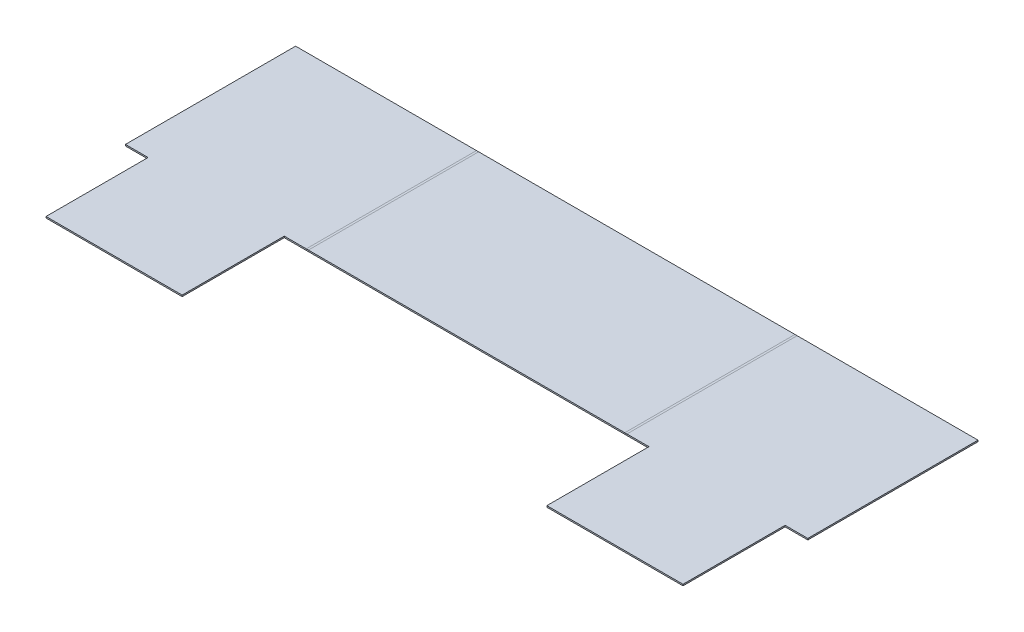
ISO-10303-21;
HEADER;
FILE_DESCRIPTION(('STEP AP214'),'2;1');
FILE_NAME('part.step','',(''),(''),'','','');
FILE_SCHEMA(('AUTOMOTIVE_DESIGN { 1 0 10303 214 1 1 1 1 }'));
ENDSEC;
DATA;
#1=APPLICATION_CONTEXT('core data for automotive mechanical design processes');
#2=APPLICATION_PROTOCOL_DEFINITION('international standard','automotive_design',2000,#1);
#3=PRODUCT_CONTEXT('',#1,'mechanical');
#4=PRODUCT('Part','Part','',(#3));
#5=PRODUCT_RELATED_PRODUCT_CATEGORY('part','',(#4));
#6=PRODUCT_DEFINITION_FORMATION('','',#4);
#7=PRODUCT_DEFINITION_CONTEXT('part definition',#1,'design');
#8=PRODUCT_DEFINITION('design','',#6,#7);
#9=PRODUCT_DEFINITION_SHAPE('','',#8);
#10=(LENGTH_UNIT() NAMED_UNIT(*) SI_UNIT(.MILLI.,.METRE.));
#11=(NAMED_UNIT(*) PLANE_ANGLE_UNIT() SI_UNIT($,.RADIAN.));
#12=(NAMED_UNIT(*) SI_UNIT($,.STERADIAN.) SOLID_ANGLE_UNIT());
#13=UNCERTAINTY_MEASURE_WITH_UNIT(LENGTH_MEASURE(1.E-05),#10,'distance_accuracy_value','');
#14=(GEOMETRIC_REPRESENTATION_CONTEXT(3) GLOBAL_UNCERTAINTY_ASSIGNED_CONTEXT((#13)) GLOBAL_UNIT_ASSIGNED_CONTEXT((#10,
#11,#12)) REPRESENTATION_CONTEXT('',''));
#15=CARTESIAN_POINT('',(0.,0.,0.));
#16=DIRECTION('',(0.,0.,1.));
#17=DIRECTION('',(1.,0.,0.));
#18=AXIS2_PLACEMENT_3D('',#15,#16,#17);
#19=CARTESIAN_POINT('',(-1.58750000000069,204.787500000001,127.));
#20=DIRECTION('',(0.,0.,1.));
#21=DIRECTION('',(0.,-1.,0.));
#22=AXIS2_PLACEMENT_3D('',#19,#20,#21);
#23=PLANE('',#22);
#24=DIRECTION('',(-1.,0.,0.));
#25=VECTOR('',#24,1.);
#26=CARTESIAN_POINT('',(355.6,0.,127.));
#27=LINE('',#26,#25);
#28=CARTESIAN_POINT('',(354.8634,0.,127.));
#29=VERTEX_POINT('',#28);
#30=CARTESIAN_POINT('',(0.736599999999959,0.,127.));
#31=VERTEX_POINT('',#30);
#32=EDGE_CURVE('E316',#29,#31,#27,.T.);
#33=ORIENTED_EDGE('',*,*,#32,.T.);
#34=DIRECTION('',(0.,1.,0.));
#35=VECTOR('',#34,1.);
#36=CARTESIAN_POINT('',(0.736599999999995,0.,127.));
#37=LINE('',#36,#35);
#38=CARTESIAN_POINT('',(0.736599999999995,1.58749999999999,127.));
#39=VERTEX_POINT('',#38);
#40=EDGE_CURVE('E11',#31,#39,#37,.T.);
#41=ORIENTED_EDGE('',*,*,#40,.T.);
#42=DIRECTION('',(-1.,0.,0.));
#43=VECTOR('',#42,1.);
#44=CARTESIAN_POINT('',(355.6,1.58749999999998,127.));
#45=LINE('',#44,#43);
#46=CARTESIAN_POINT('',(354.8634,1.58749999999998,127.));
#47=VERTEX_POINT('',#46);
#48=EDGE_CURVE('E309',#47,#39,#45,.T.);
#49=ORIENTED_EDGE('',*,*,#48,.F.);
#50=DIRECTION('',(0.,-1.,0.));
#51=VECTOR('',#50,1.);
#52=CARTESIAN_POINT('',(354.8634,1.58749999999998,127.));
#53=LINE('',#52,#51);
#54=EDGE_CURVE('E326',#47,#29,#53,.T.);
#55=ORIENTED_EDGE('',*,*,#54,.T.);
#56=EDGE_LOOP('',(#33,#41,#49,#55));
#57=FACE_BOUND('',#56,.T.);
#58=ADVANCED_FACE('F41',(#57),#23,.F.);
#59=CARTESIAN_POINT('',(355.6,1.5875,0.));
#60=DIRECTION('',(0.,-1.,0.));
#61=DIRECTION('',(0.,0.,-1.));
#62=AXIS2_PLACEMENT_3D('',#59,#60,#61);
#63=PLANE('',#62);
#64=DIRECTION('',(0.,0.,1.));
#65=VECTOR('',#64,1.);
#66=CARTESIAN_POINT('',(354.8634,1.58749999999999,0.));
#67=LINE('',#66,#65);
#68=CARTESIAN_POINT('',(354.8634,1.58749999999999,317.5));
#69=VERTEX_POINT('',#68);
#70=EDGE_CURVE('E329',#47,#69,#67,.T.);
#71=ORIENTED_EDGE('',*,*,#70,.F.);
#72=ORIENTED_EDGE('',*,*,#48,.T.);
#73=DIRECTION('',(0.,0.,-1.));
#74=VECTOR('',#73,1.);
#75=CARTESIAN_POINT('',(0.736599999999997,1.58749999999999,317.5));
#76=LINE('',#75,#74);
#77=CARTESIAN_POINT('',(0.736599999999973,1.58749999999998,317.5));
#78=VERTEX_POINT('',#77);
#79=EDGE_CURVE('E48',#78,#39,#76,.T.);
#80=ORIENTED_EDGE('',*,*,#79,.F.);
#81=DIRECTION('',(-1.,0.,0.));
#82=VECTOR('',#81,1.);
#83=CARTESIAN_POINT('',(355.6,1.58749999999996,317.5));
#84=LINE('',#83,#82);
#85=EDGE_CURVE('E63',#69,#78,#84,.T.);
#86=ORIENTED_EDGE('',*,*,#85,.F.);
#87=EDGE_LOOP('',(#71,#72,#80,#86));
#88=FACE_BOUND('',#87,.T.);
#89=ADVANCED_FACE('F343',(#88),#63,.F.);
#90=CARTESIAN_POINT('',(355.6,0.,0.));
#91=DIRECTION('',(0.,-1.,0.));
#92=DIRECTION('',(0.,0.,-1.));
#93=AXIS2_PLACEMENT_3D('',#90,#91,#92);
#94=PLANE('',#93);
#95=ORIENTED_EDGE('',*,*,#32,.F.);
#96=DIRECTION('',(0.,0.,1.));
#97=VECTOR('',#96,1.);
#98=CARTESIAN_POINT('',(354.8634,0.,0.));
#99=LINE('',#98,#97);
#100=CARTESIAN_POINT('',(354.8634,0.,317.5));
#101=VERTEX_POINT('',#100);
#102=EDGE_CURVE('E323',#29,#101,#99,.T.);
#103=ORIENTED_EDGE('',*,*,#102,.T.);
#104=DIRECTION('',(-1.,0.,0.));
#105=VECTOR('',#104,1.);
#106=CARTESIAN_POINT('',(355.6,0.,317.5));
#107=LINE('',#106,#105);
#108=CARTESIAN_POINT('',(0.736599999999973,0.,317.5));
#109=VERTEX_POINT('',#108);
#110=EDGE_CURVE('E319',#101,#109,#107,.T.);
#111=ORIENTED_EDGE('',*,*,#110,.T.);
#112=DIRECTION('',(0.,0.,-1.));
#113=VECTOR('',#112,1.);
#114=CARTESIAN_POINT('',(0.736599999999973,0.,317.5));
#115=LINE('',#114,#113);
#116=EDGE_CURVE('E335',#109,#31,#115,.T.);
#117=ORIENTED_EDGE('',*,*,#116,.T.);
#118=EDGE_LOOP('',(#95,#103,#111,#117));
#119=FACE_BOUND('',#118,.T.);
#120=ADVANCED_FACE('F405',(#119),#94,.T.);
#121=CARTESIAN_POINT('',(355.6,0.,317.5));
#122=DIRECTION('',(0.,0.,1.));
#123=DIRECTION('',(1.,0.,0.));
#124=AXIS2_PLACEMENT_3D('',#121,#122,#123);
#125=PLANE('',#124);
#126=ORIENTED_EDGE('',*,*,#85,.T.);
#127=DIRECTION('',(0.,-1.,0.));
#128=VECTOR('',#127,1.);
#129=CARTESIAN_POINT('',(0.736599999999997,1.58749999999999,317.5));
#130=LINE('',#129,#128);
#131=EDGE_CURVE('E338',#78,#109,#130,.T.);
#132=ORIENTED_EDGE('',*,*,#131,.T.);
#133=ORIENTED_EDGE('',*,*,#110,.F.);
#134=DIRECTION('',(0.,-1.,0.));
#135=VECTOR('',#134,1.);
#136=CARTESIAN_POINT('',(354.8634,1.58749999999999,317.5));
#137=LINE('',#136,#135);
#138=EDGE_CURVE('E332',#69,#101,#137,.T.);
#139=ORIENTED_EDGE('',*,*,#138,.F.);
#140=EDGE_LOOP('',(#126,#132,#133,#139));
#141=FACE_BOUND('',#140,.T.);
#142=ADVANCED_FACE('F409',(#141),#125,.T.);
#143=CARTESIAN_POINT('',(357.267268158711,0.,127.));
#144=DIRECTION('',(0.,0.,-1.));
#145=DIRECTION('',(1.,0.,0.));
#146=AXIS2_PLACEMENT_3D('',#143,#144,#145);
#147=PLANE('',#146);
#148=ORIENTED_EDGE('',*,*,#54,.F.);
#149=DIRECTION('',(1.,0.,0.));
#150=VECTOR('',#149,1.);
#151=CARTESIAN_POINT('',(356.065334079355,1.58750000000001,127.));
#152=LINE('',#151,#150);
#153=CARTESIAN_POINT('',(357.267268158711,1.58750000000002,127.));
#154=VERTEX_POINT('',#153);
#155=EDGE_CURVE('E246',#47,#154,#152,.T.);
#156=ORIENTED_EDGE('',*,*,#155,.T.);
#157=DIRECTION('',(0.,1.,0.));
#158=VECTOR('',#157,1.);
#159=CARTESIAN_POINT('',(357.267268158711,0.,127.));
#160=LINE('',#159,#158);
#161=CARTESIAN_POINT('',(357.267268158711,0.,127.));
#162=VERTEX_POINT('',#161);
#163=EDGE_CURVE('E257',#162,#154,#160,.T.);
#164=ORIENTED_EDGE('',*,*,#163,.F.);
#165=DIRECTION('',(1.,0.,0.));
#166=VECTOR('',#165,1.);
#167=CARTESIAN_POINT('',(357.267268158711,0.,127.));
#168=LINE('',#167,#166);
#169=EDGE_CURVE('E302',#29,#162,#168,.T.);
#170=ORIENTED_EDGE('',*,*,#169,.F.);
#171=EDGE_LOOP('',(#148,#156,#164,#170));
#172=FACE_BOUND('',#171,.T.);
#173=ADVANCED_FACE('F414',(#172),#147,.T.);
#174=CARTESIAN_POINT('',(354.8634,0.,317.5));
#175=DIRECTION('',(0.,0.,1.));
#176=DIRECTION('',(-1.,0.,0.));
#177=AXIS2_PLACEMENT_3D('',#174,#175,#176);
#178=PLANE('',#177);
#179=DIRECTION('',(0.,-1.,0.));
#180=VECTOR('',#179,1.);
#181=CARTESIAN_POINT('',(357.267268158711,1.58750000000002,317.5));
#182=LINE('',#181,#180);
#183=CARTESIAN_POINT('',(357.267268158711,1.58750000000002,317.5));
#184=VERTEX_POINT('',#183);
#185=CARTESIAN_POINT('',(357.267268158711,0.,317.5));
#186=VERTEX_POINT('',#185);
#187=EDGE_CURVE('E244',#184,#186,#182,.T.);
#188=ORIENTED_EDGE('',*,*,#187,.F.);
#189=DIRECTION('',(1.,0.,0.));
#190=VECTOR('',#189,1.);
#191=CARTESIAN_POINT('',(356.065334079355,1.58749999999998,317.5));
#192=LINE('',#191,#190);
#193=EDGE_CURVE('E306',#184,#69,#192,.F.);
#194=ORIENTED_EDGE('',*,*,#193,.T.);
#195=ORIENTED_EDGE('',*,*,#138,.T.);
#196=DIRECTION('',(-1.,0.,0.));
#197=VECTOR('',#196,1.);
#198=CARTESIAN_POINT('',(354.8634,0.,317.5));
#199=LINE('',#198,#197);
#200=EDGE_CURVE('E305',#186,#101,#199,.T.);
#201=ORIENTED_EDGE('',*,*,#200,.F.);
#202=EDGE_LOOP('',(#188,#194,#195,#201));
#203=FACE_BOUND('',#202,.T.);
#204=ADVANCED_FACE('F419',(#203),#178,.T.);
#205=CARTESIAN_POINT('',(356.065334079355,0.,222.25));
#206=DIRECTION('',(0.,-1.,0.));
#207=DIRECTION('',(0.,0.,-1.));
#208=AXIS2_PLACEMENT_3D('',#205,#206,#207);
#209=PLANE('',#208);
#210=ORIENTED_EDGE('',*,*,#200,.T.);
#211=ORIENTED_EDGE('',*,*,#102,.F.);
#212=ORIENTED_EDGE('',*,*,#169,.T.);
#213=DIRECTION('',(0.,0.,1.));
#214=VECTOR('',#213,1.);
#215=CARTESIAN_POINT('',(357.267268158711,0.,0.));
#216=LINE('',#215,#214);
#217=EDGE_CURVE('E240',#162,#186,#216,.T.);
#218=ORIENTED_EDGE('',*,*,#217,.T.);
#219=EDGE_LOOP('',(#210,#211,#212,#218));
#220=FACE_BOUND('',#219,.T.);
#221=ADVANCED_FACE('F423',(#220),#209,.T.);
#222=CARTESIAN_POINT('',(356.065334079355,1.58749999999999,222.25));
#223=DIRECTION('',(0.,-1.,0.));
#224=DIRECTION('',(0.,0.,-1.));
#225=AXIS2_PLACEMENT_3D('',#222,#223,#224);
#226=PLANE('',#225);
#227=ORIENTED_EDGE('',*,*,#193,.F.);
#228=DIRECTION('',(0.,0.,-1.));
#229=VECTOR('',#228,1.);
#230=CARTESIAN_POINT('',(357.267268158711,1.58750000000002,317.5));
#231=LINE('',#230,#229);
#232=EDGE_CURVE('E297',#184,#154,#231,.T.);
#233=ORIENTED_EDGE('',*,*,#232,.T.);
#234=ORIENTED_EDGE('',*,*,#155,.F.);
#235=ORIENTED_EDGE('',*,*,#70,.T.);
#236=EDGE_LOOP('',(#227,#233,#234,#235));
#237=FACE_BOUND('',#236,.T.);
#238=ADVANCED_FACE('F425',(#237),#226,.F.);
#239=CARTESIAN_POINT('',(381.930668158711,1.5874999999998,317.5));
#240=DIRECTION('',(-1.,0.,0.));
#241=DIRECTION('',(0.,-1.,0.));
#242=AXIS2_PLACEMENT_3D('',#239,#240,#241);
#243=PLANE('',#242);
#244=DIRECTION('',(0.,0.,-1.));
#245=VECTOR('',#244,1.);
#246=CARTESIAN_POINT('',(381.930668158711,-2.22044604925031E-13,317.5));
#247=LINE('',#246,#245);
#248=CARTESIAN_POINT('',(381.930668158711,-2.22044604925031E-13,431.8));
#249=VERTEX_POINT('',#248);
#250=CARTESIAN_POINT('',(381.930668158711,-2.22044604925031E-13,317.5));
#251=VERTEX_POINT('',#250);
#252=EDGE_CURVE('E268',#249,#251,#247,.T.);
#253=ORIENTED_EDGE('',*,*,#252,.F.);
#254=DIRECTION('',(0.,-1.,0.));
#255=VECTOR('',#254,1.);
#256=CARTESIAN_POINT('',(381.930668158711,1.5874999999998,431.8));
#257=LINE('',#256,#255);
#258=CARTESIAN_POINT('',(381.930668158711,1.5874999999998,431.8));
#259=VERTEX_POINT('',#258);
#260=EDGE_CURVE('E288',#259,#249,#257,.T.);
#261=ORIENTED_EDGE('',*,*,#260,.F.);
#262=DIRECTION('',(0.,0.,-1.));
#263=VECTOR('',#262,1.);
#264=CARTESIAN_POINT('',(381.930668158711,1.5874999999998,317.5));
#265=LINE('',#264,#263);
#266=CARTESIAN_POINT('',(381.930668158711,1.5874999999998,317.5));
#267=VERTEX_POINT('',#266);
#268=EDGE_CURVE('E295',#259,#267,#265,.T.);
#269=ORIENTED_EDGE('',*,*,#268,.T.);
#270=DIRECTION('',(0.,-1.,0.));
#271=VECTOR('',#270,1.);
#272=CARTESIAN_POINT('',(381.930668158711,1.5874999999998,317.5));
#273=LINE('',#272,#271);
#274=EDGE_CURVE('E293',#267,#251,#273,.T.);
#275=ORIENTED_EDGE('',*,*,#274,.T.);
#276=EDGE_LOOP('',(#253,#261,#269,#275));
#277=FACE_BOUND('',#276,.T.);
#278=ADVANCED_FACE('F428',(#277),#243,.T.);
#279=CARTESIAN_POINT('',(381.930668158711,1.5874999999998,431.8));
#280=DIRECTION('',(0.,0.,1.));
#281=DIRECTION('',(0.,-1.,0.));
#282=AXIS2_PLACEMENT_3D('',#279,#280,#281);
#283=PLANE('',#282);
#284=DIRECTION('',(-1.,0.,0.));
#285=VECTOR('',#284,1.);
#286=CARTESIAN_POINT('',(381.930668158711,-2.22044604925031E-13,431.8));
#287=LINE('',#286,#285);
#288=CARTESIAN_POINT('',(534.330668158711,-1.22124532708767E-12,431.8));
#289=VERTEX_POINT('',#288);
#290=EDGE_CURVE('E271',#289,#249,#287,.T.);
#291=ORIENTED_EDGE('',*,*,#290,.F.);
#292=DIRECTION('',(0.,-1.,0.));
#293=VECTOR('',#292,1.);
#294=CARTESIAN_POINT('',(534.330668158711,1.5874999999988,431.8));
#295=LINE('',#294,#293);
#296=CARTESIAN_POINT('',(534.330668158711,1.5874999999988,431.8));
#297=VERTEX_POINT('',#296);
#298=EDGE_CURVE('E252',#297,#289,#295,.T.);
#299=ORIENTED_EDGE('',*,*,#298,.F.);
#300=DIRECTION('',(-1.,0.,0.));
#301=VECTOR('',#300,1.);
#302=CARTESIAN_POINT('',(381.930668158711,1.5874999999998,431.8));
#303=LINE('',#302,#301);
#304=EDGE_CURVE('E290',#297,#259,#303,.T.);
#305=ORIENTED_EDGE('',*,*,#304,.T.);
#306=ORIENTED_EDGE('',*,*,#260,.T.);
#307=EDGE_LOOP('',(#291,#299,#305,#306));
#308=FACE_BOUND('',#307,.T.);
#309=ADVANCED_FACE('F457',(#308),#283,.T.);
#310=CARTESIAN_POINT('',(534.330668158711,1.5874999999988,431.8));
#311=DIRECTION('',(1.,0.,0.));
#312=DIRECTION('',(0.,1.,0.));
#313=AXIS2_PLACEMENT_3D('',#310,#311,#312);
#314=PLANE('',#313);
#315=DIRECTION('',(0.,0.,1.));
#316=VECTOR('',#315,1.);
#317=CARTESIAN_POINT('',(534.330668158711,-1.22124532708767E-12,431.8));
#318=LINE('',#317,#316);
#319=CARTESIAN_POINT('',(534.330668158711,-1.22124532708767E-12,317.5));
#320=VERTEX_POINT('',#319);
#321=EDGE_CURVE('E266',#320,#289,#318,.T.);
#322=ORIENTED_EDGE('',*,*,#321,.F.);
#323=DIRECTION('',(0.,-1.,0.));
#324=VECTOR('',#323,1.);
#325=CARTESIAN_POINT('',(534.330668158711,1.5874999999988,317.5));
#326=LINE('',#325,#324);
#327=CARTESIAN_POINT('',(534.330668158711,1.5874999999988,317.5));
#328=VERTEX_POINT('',#327);
#329=EDGE_CURVE('E251',#328,#320,#326,.T.);
#330=ORIENTED_EDGE('',*,*,#329,.F.);
#331=DIRECTION('',(0.,0.,1.));
#332=VECTOR('',#331,1.);
#333=CARTESIAN_POINT('',(534.330668158711,1.5874999999988,431.8));
#334=LINE('',#333,#332);
#335=EDGE_CURVE('E285',#328,#297,#334,.T.);
#336=ORIENTED_EDGE('',*,*,#335,.T.);
#337=ORIENTED_EDGE('',*,*,#298,.T.);
#338=EDGE_LOOP('',(#322,#330,#336,#337));
#339=FACE_BOUND('',#338,.T.);
#340=ADVANCED_FACE('F454',(#339),#314,.T.);
#341=CARTESIAN_POINT('',(356.530668158711,0.,317.5));
#342=DIRECTION('',(0.,0.,-1.));
#343=DIRECTION('',(0.,1.,0.));
#344=AXIS2_PLACEMENT_3D('',#341,#342,#343);
#345=PLANE('',#344);
#346=DIRECTION('',(-1.,0.,0.));
#347=VECTOR('',#346,1.);
#348=CARTESIAN_POINT('',(356.530668158711,1.58750000000002,317.5));
#349=LINE('',#348,#347);
#350=CARTESIAN_POINT('',(559.730668158711,1.58749999999858,317.5));
#351=VERTEX_POINT('',#350);
#352=EDGE_CURVE('E248',#351,#328,#349,.T.);
#353=ORIENTED_EDGE('',*,*,#352,.T.);
#354=ORIENTED_EDGE('',*,*,#329,.T.);
#355=DIRECTION('',(-1.,0.,0.));
#356=VECTOR('',#355,1.);
#357=CARTESIAN_POINT('',(356.530668158711,0.,317.5));
#358=LINE('',#357,#356);
#359=CARTESIAN_POINT('',(559.730668158711,-1.4432899320127E-12,317.5));
#360=VERTEX_POINT('',#359);
#361=EDGE_CURVE('E263',#360,#320,#358,.T.);
#362=ORIENTED_EDGE('',*,*,#361,.F.);
#363=DIRECTION('',(0.,1.,0.));
#364=VECTOR('',#363,1.);
#365=CARTESIAN_POINT('',(559.730668158711,-1.4432899320127E-12,317.5));
#366=LINE('',#365,#364);
#367=EDGE_CURVE('E279',#360,#351,#366,.T.);
#368=ORIENTED_EDGE('',*,*,#367,.T.);
#369=EDGE_LOOP('',(#353,#354,#362,#368));
#370=FACE_BOUND('',#369,.T.);
#371=ADVANCED_FACE('F449',(#370),#345,.F.);
#372=CARTESIAN_POINT('',(559.730668158711,-1.4432899320127E-12,317.5));
#373=DIRECTION('',(-1.,0.,0.));
#374=DIRECTION('',(0.,-1.,0.));
#375=AXIS2_PLACEMENT_3D('',#372,#373,#374);
#376=PLANE('',#375);
#377=DIRECTION('',(0.,0.,1.));
#378=VECTOR('',#377,1.);
#379=CARTESIAN_POINT('',(559.730668158711,-1.4432899320127E-12,317.5));
#380=LINE('',#379,#378);
#381=CARTESIAN_POINT('',(559.730668158711,-1.38777878078145E-12,127.));
#382=VERTEX_POINT('',#381);
#383=EDGE_CURVE('E267',#382,#360,#380,.T.);
#384=ORIENTED_EDGE('',*,*,#383,.F.);
#385=DIRECTION('',(0.,-1.,0.));
#386=VECTOR('',#385,1.);
#387=CARTESIAN_POINT('',(559.730668158713,358.775,127.));
#388=LINE('',#387,#386);
#389=CARTESIAN_POINT('',(559.730668158711,1.58749999999858,127.));
#390=VERTEX_POINT('',#389);
#391=EDGE_CURVE('E253',#390,#382,#388,.T.);
#392=ORIENTED_EDGE('',*,*,#391,.F.);
#393=DIRECTION('',(0.,0.,1.));
#394=VECTOR('',#393,1.);
#395=CARTESIAN_POINT('',(559.730668158711,1.58749999999858,317.5));
#396=LINE('',#395,#394);
#397=EDGE_CURVE('E277',#390,#351,#396,.T.);
#398=ORIENTED_EDGE('',*,*,#397,.T.);
#399=ORIENTED_EDGE('',*,*,#367,.F.);
#400=EDGE_LOOP('',(#384,#392,#398,#399));
#401=FACE_BOUND('',#400,.T.);
#402=ADVANCED_FACE('F445',(#401),#376,.F.);
#403=CARTESIAN_POINT('',(354.943168158709,0.,0.));
#404=DIRECTION('',(0.,1.,0.));
#405=DIRECTION('',(-1.,0.,0.));
#406=AXIS2_PLACEMENT_3D('',#403,#404,#405);
#407=PLANE('',#406);
#408=ORIENTED_EDGE('',*,*,#217,.F.);
#409=DIRECTION('',(-1.,0.,0.));
#410=VECTOR('',#409,1.);
#411=CARTESIAN_POINT('',(559.730668158711,-1.38777878078145E-12,127.));
#412=LINE('',#411,#410);
#413=EDGE_CURVE('E260',#382,#162,#412,.T.);
#414=ORIENTED_EDGE('',*,*,#413,.F.);
#415=ORIENTED_EDGE('',*,*,#383,.T.);
#416=ORIENTED_EDGE('',*,*,#361,.T.);
#417=ORIENTED_EDGE('',*,*,#321,.T.);
#418=ORIENTED_EDGE('',*,*,#290,.T.);
#419=ORIENTED_EDGE('',*,*,#252,.T.);
#420=EDGE_CURVE('E262',#251,#186,#358,.T.);
#421=ORIENTED_EDGE('',*,*,#420,.T.);
#422=EDGE_LOOP('',(#408,#414,#415,#416,#417,#418,#419,#421));
#423=FACE_BOUND('',#422,.T.);
#424=ADVANCED_FACE('F441',(#423),#407,.F.);
#425=CARTESIAN_POINT('',(559.730668158713,358.775,127.));
#426=DIRECTION('',(0.,0.,1.));
#427=DIRECTION('',(-1.,0.,0.));
#428=AXIS2_PLACEMENT_3D('',#425,#426,#427);
#429=PLANE('',#428);
#430=ORIENTED_EDGE('',*,*,#413,.T.);
#431=ORIENTED_EDGE('',*,*,#163,.T.);
#432=DIRECTION('',(1.,0.,0.));
#433=VECTOR('',#432,1.);
#434=CARTESIAN_POINT('',(354.943168158709,1.58750000000002,127.));
#435=LINE('',#434,#433);
#436=EDGE_CURVE('E255',#154,#390,#435,.T.);
#437=ORIENTED_EDGE('',*,*,#436,.T.);
#438=ORIENTED_EDGE('',*,*,#391,.T.);
#439=EDGE_LOOP('',(#430,#431,#437,#438));
#440=FACE_BOUND('',#439,.T.);
#441=ADVANCED_FACE('F437',(#440),#429,.F.);
#442=CARTESIAN_POINT('',(354.943168158709,1.58750000000002,0.));
#443=DIRECTION('',(0.,1.,0.));
#444=DIRECTION('',(-1.,0.,0.));
#445=AXIS2_PLACEMENT_3D('',#442,#443,#444);
#446=PLANE('',#445);
#447=ORIENTED_EDGE('',*,*,#436,.F.);
#448=ORIENTED_EDGE('',*,*,#232,.F.);
#449=EDGE_CURVE('E247',#267,#184,#349,.T.);
#450=ORIENTED_EDGE('',*,*,#449,.F.);
#451=ORIENTED_EDGE('',*,*,#268,.F.);
#452=ORIENTED_EDGE('',*,*,#304,.F.);
#453=ORIENTED_EDGE('',*,*,#335,.F.);
#454=ORIENTED_EDGE('',*,*,#352,.F.);
#455=ORIENTED_EDGE('',*,*,#397,.F.);
#456=EDGE_LOOP('',(#447,#448,#450,#451,#452,#453,#454,#455));
#457=FACE_BOUND('',#456,.T.);
#458=ADVANCED_FACE('F433',(#457),#446,.T.);
#459=ORIENTED_EDGE('',*,*,#274,.F.);
#460=ORIENTED_EDGE('',*,*,#449,.T.);
#461=ORIENTED_EDGE('',*,*,#187,.T.);
#462=ORIENTED_EDGE('',*,*,#420,.F.);
#463=EDGE_LOOP('',(#459,#460,#461,#462));
#464=FACE_BOUND('',#463,.T.);
#465=ADVANCED_FACE('F436',(#464),#345,.F.);
#466=CARTESIAN_POINT('',(0.736599999999959,0.,127.));
#467=DIRECTION('',(0.,0.,-1.));
#468=DIRECTION('',(1.,0.,0.));
#469=AXIS2_PLACEMENT_3D('',#466,#467,#468);
#470=PLANE('',#469);
#471=DIRECTION('',(0.,-1.,0.));
#472=VECTOR('',#471,1.);
#473=CARTESIAN_POINT('',(-1.66726815871065,1.58750000000001,127.));
#474=LINE('',#473,#472);
#475=CARTESIAN_POINT('',(-1.66726815871065,1.58750000000001,127.));
#476=VERTEX_POINT('',#475);
#477=CARTESIAN_POINT('',(-1.6672681587106,-1.34029072562658E-12,127.));
#478=VERTEX_POINT('',#477);
#479=EDGE_CURVE('E190',#476,#478,#474,.T.);
#480=ORIENTED_EDGE('',*,*,#479,.F.);
#481=DIRECTION('',(1.,0.,0.));
#482=VECTOR('',#481,1.);
#483=CARTESIAN_POINT('',(-0.465334079355322,1.5875,127.));
#484=LINE('',#483,#482);
#485=EDGE_CURVE('E55',#476,#39,#484,.T.);
#486=ORIENTED_EDGE('',*,*,#485,.T.);
#487=ORIENTED_EDGE('',*,*,#40,.F.);
#488=DIRECTION('',(1.,0.,0.));
#489=VECTOR('',#488,1.);
#490=CARTESIAN_POINT('',(0.736599999999959,0.,127.));
#491=LINE('',#490,#489);
#492=EDGE_CURVE('E233',#478,#31,#491,.T.);
#493=ORIENTED_EDGE('',*,*,#492,.F.);
#494=EDGE_LOOP('',(#480,#486,#487,#493));
#495=FACE_BOUND('',#494,.T.);
#496=ADVANCED_FACE('F347',(#495),#470,.T.);
#497=CARTESIAN_POINT('',(-1.66726815871058,0.,317.5));
#498=DIRECTION('',(0.,0.,1.));
#499=DIRECTION('',(-1.,0.,0.));
#500=AXIS2_PLACEMENT_3D('',#497,#498,#499);
#501=PLANE('',#500);
#502=ORIENTED_EDGE('',*,*,#131,.F.);
#503=DIRECTION('',(1.,0.,0.));
#504=VECTOR('',#503,1.);
#505=CARTESIAN_POINT('',(-0.465334079355322,1.58749999999998,317.5));
#506=LINE('',#505,#504);
#507=CARTESIAN_POINT('',(-1.66726815871063,1.58750000000002,317.5));
#508=VERTEX_POINT('',#507);
#509=EDGE_CURVE('E237',#78,#508,#506,.F.);
#510=ORIENTED_EDGE('',*,*,#509,.T.);
#511=DIRECTION('',(0.,-1.,0.));
#512=VECTOR('',#511,1.);
#513=CARTESIAN_POINT('',(-1.66726815871061,1.58749999999999,317.5));
#514=LINE('',#513,#512);
#515=CARTESIAN_POINT('',(-1.66726815871058,0.,317.5));
#516=VERTEX_POINT('',#515);
#517=EDGE_CURVE('E226',#508,#516,#514,.T.);
#518=ORIENTED_EDGE('',*,*,#517,.T.);
#519=DIRECTION('',(-1.,0.,0.));
#520=VECTOR('',#519,1.);
#521=CARTESIAN_POINT('',(-1.66726815871058,0.,317.5));
#522=LINE('',#521,#520);
#523=EDGE_CURVE('E236',#109,#516,#522,.T.);
#524=ORIENTED_EDGE('',*,*,#523,.F.);
#525=EDGE_LOOP('',(#502,#510,#518,#524));
#526=FACE_BOUND('',#525,.T.);
#527=ADVANCED_FACE('F359',(#526),#501,.T.);
#528=CARTESIAN_POINT('',(-0.465334079355322,0.,222.25));
#529=DIRECTION('',(0.,-1.,0.));
#530=DIRECTION('',(0.,0.,-1.));
#531=AXIS2_PLACEMENT_3D('',#528,#529,#530);
#532=PLANE('',#531);
#533=ORIENTED_EDGE('',*,*,#523,.T.);
#534=DIRECTION('',(0.,0.,-1.));
#535=VECTOR('',#534,1.);
#536=CARTESIAN_POINT('',(-1.66726815871066,0.,0.));
#537=LINE('',#536,#535);
#538=EDGE_CURVE('E230',#516,#478,#537,.T.);
#539=ORIENTED_EDGE('',*,*,#538,.T.);
#540=ORIENTED_EDGE('',*,*,#492,.T.);
#541=ORIENTED_EDGE('',*,*,#116,.F.);
#542=EDGE_LOOP('',(#533,#539,#540,#541));
#543=FACE_BOUND('',#542,.T.);
#544=ADVANCED_FACE('F349',(#543),#532,.T.);
#545=CARTESIAN_POINT('',(-0.465334079355322,1.58749999999999,222.25));
#546=DIRECTION('',(0.,-1.,0.));
#547=DIRECTION('',(0.,0.,-1.));
#548=AXIS2_PLACEMENT_3D('',#545,#546,#547);
#549=PLANE('',#548);
#550=ORIENTED_EDGE('',*,*,#509,.F.);
#551=ORIENTED_EDGE('',*,*,#79,.T.);
#552=ORIENTED_EDGE('',*,*,#485,.F.);
#553=DIRECTION('',(0.,0.,1.));
#554=VECTOR('',#553,1.);
#555=CARTESIAN_POINT('',(-1.66726815871068,1.58750000000002,0.));
#556=LINE('',#555,#554);
#557=EDGE_CURVE('E198',#476,#508,#556,.T.);
#558=ORIENTED_EDGE('',*,*,#557,.T.);
#559=EDGE_LOOP('',(#550,#551,#552,#558));
#560=FACE_BOUND('',#559,.T.);
#561=ADVANCED_FACE('F342',(#560),#549,.F.);
#562=CARTESIAN_POINT('',(-204.130668158711,-1.4213890481285E-12,317.5));
#563=DIRECTION('',(0.,0.,-1.));
#564=DIRECTION('',(0.,-1.,0.));
#565=AXIS2_PLACEMENT_3D('',#562,#563,#564);
#566=PLANE('',#565);
#567=DIRECTION('',(0.,-1.,0.));
#568=VECTOR('',#567,1.);
#569=CARTESIAN_POINT('',(-178.730668158711,1.58749999999877,317.5));
#570=LINE('',#569,#568);
#571=CARTESIAN_POINT('',(-178.730668158711,1.58749999999877,317.5));
#572=VERTEX_POINT('',#571);
#573=CARTESIAN_POINT('',(-178.730668158711,-1.25333771139324E-12,317.5));
#574=VERTEX_POINT('',#573);
#575=EDGE_CURVE('E220',#572,#574,#570,.T.);
#576=ORIENTED_EDGE('',*,*,#575,.F.);
#577=DIRECTION('',(-1.,0.,0.));
#578=VECTOR('',#577,1.);
#579=CARTESIAN_POINT('',(-204.130668158711,1.58749999999858,317.5));
#580=LINE('',#579,#578);
#581=CARTESIAN_POINT('',(-204.130668158711,1.58749999999858,317.5));
#582=VERTEX_POINT('',#581);
#583=EDGE_CURVE('E225',#572,#582,#580,.T.);
#584=ORIENTED_EDGE('',*,*,#583,.T.);
#585=DIRECTION('',(0.,1.,0.));
#586=VECTOR('',#585,1.);
#587=CARTESIAN_POINT('',(-204.130668158711,-1.4213890481285E-12,317.5));
#588=LINE('',#587,#586);
#589=CARTESIAN_POINT('',(-204.130668158711,-1.4213890481285E-12,317.5));
#590=VERTEX_POINT('',#589);
#591=EDGE_CURVE('E204',#590,#582,#588,.T.);
#592=ORIENTED_EDGE('',*,*,#591,.F.);
#593=DIRECTION('',(-1.,0.,0.));
#594=VECTOR('',#593,1.);
#595=CARTESIAN_POINT('',(-204.130668158711,-1.4213890481285E-12,317.5));
#596=LINE('',#595,#594);
#597=EDGE_CURVE('E367',#574,#590,#596,.T.);
#598=ORIENTED_EDGE('',*,*,#597,.F.);
#599=EDGE_LOOP('',(#576,#584,#592,#598));
#600=FACE_BOUND('',#599,.T.);
#601=ADVANCED_FACE('F376',(#600),#566,.F.);
#602=CARTESIAN_POINT('',(-178.730668158711,1.58749999999876,431.8));
#603=DIRECTION('',(-1.,0.,0.));
#604=DIRECTION('',(0.,1.,0.));
#605=AXIS2_PLACEMENT_3D('',#602,#603,#604);
#606=PLANE('',#605);
#607=DIRECTION('',(0.,0.,1.));
#608=VECTOR('',#607,1.);
#609=CARTESIAN_POINT('',(-178.730668158711,-1.26179448833863E-12,431.8));
#610=LINE('',#609,#608);
#611=CARTESIAN_POINT('',(-178.730668158711,-1.26179448833863E-12,431.8));
#612=VERTEX_POINT('',#611);
#613=EDGE_CURVE('E222',#574,#612,#610,.T.);
#614=ORIENTED_EDGE('',*,*,#613,.T.);
#615=DIRECTION('',(0.,-1.,0.));
#616=VECTOR('',#615,1.);
#617=CARTESIAN_POINT('',(-178.730668158711,1.58749999999876,431.8));
#618=LINE('',#617,#616);
#619=CARTESIAN_POINT('',(-178.730668158711,1.58749999999876,431.8));
#620=VERTEX_POINT('',#619);
#621=EDGE_CURVE('E215',#620,#612,#618,.T.);
#622=ORIENTED_EDGE('',*,*,#621,.F.);
#623=DIRECTION('',(0.,0.,1.));
#624=VECTOR('',#623,1.);
#625=CARTESIAN_POINT('',(-178.730668158711,1.58749999999876,431.8));
#626=LINE('',#625,#624);
#627=EDGE_CURVE('E378',#572,#620,#626,.T.);
#628=ORIENTED_EDGE('',*,*,#627,.F.);
#629=ORIENTED_EDGE('',*,*,#575,.T.);
#630=EDGE_LOOP('',(#614,#622,#628,#629));
#631=FACE_BOUND('',#630,.T.);
#632=ADVANCED_FACE('F392',(#631),#606,.T.);
#633=CARTESIAN_POINT('',(-26.3306681587106,1.58749999999979,431.8));
#634=DIRECTION('',(0.,0.,1.));
#635=DIRECTION('',(0.,-1.,0.));
#636=AXIS2_PLACEMENT_3D('',#633,#634,#635);
#637=PLANE('',#636);
#638=DIRECTION('',(1.,0.,0.));
#639=VECTOR('',#638,1.);
#640=CARTESIAN_POINT('',(-26.3306681587106,-2.30284541435921E-13,431.8));
#641=LINE('',#640,#639);
#642=CARTESIAN_POINT('',(-26.3306681587106,-2.30284541435921E-13,431.8));
#643=VERTEX_POINT('',#642);
#644=EDGE_CURVE('E218',#612,#643,#641,.T.);
#645=ORIENTED_EDGE('',*,*,#644,.T.);
#646=DIRECTION('',(0.,-1.,0.));
#647=VECTOR('',#646,1.);
#648=CARTESIAN_POINT('',(-26.3306681587106,1.58749999999979,431.8));
#649=LINE('',#648,#647);
#650=CARTESIAN_POINT('',(-26.3306681587106,1.58749999999979,431.8));
#651=VERTEX_POINT('',#650);
#652=EDGE_CURVE('E205',#651,#643,#649,.T.);
#653=ORIENTED_EDGE('',*,*,#652,.F.);
#654=DIRECTION('',(1.,0.,0.));
#655=VECTOR('',#654,1.);
#656=CARTESIAN_POINT('',(-26.3306681587106,1.58749999999979,431.8));
#657=LINE('',#656,#655);
#658=EDGE_CURVE('E379',#620,#651,#657,.T.);
#659=ORIENTED_EDGE('',*,*,#658,.F.);
#660=ORIENTED_EDGE('',*,*,#621,.T.);
#661=EDGE_LOOP('',(#645,#653,#659,#660));
#662=FACE_BOUND('',#661,.T.);
#663=ADVANCED_FACE('F390',(#662),#637,.T.);
#664=CARTESIAN_POINT('',(-26.3306681587107,1.5874999999998,317.5));
#665=DIRECTION('',(1.,0.,0.));
#666=DIRECTION('',(0.,-1.,0.));
#667=AXIS2_PLACEMENT_3D('',#664,#665,#666);
#668=PLANE('',#667);
#669=DIRECTION('',(0.,0.,-1.));
#670=VECTOR('',#669,1.);
#671=CARTESIAN_POINT('',(-26.3306681587106,-2.21827764490534E-13,317.5));
#672=LINE('',#671,#670);
#673=CARTESIAN_POINT('',(-26.3306681587106,-1.79977560632594E-13,317.5));
#674=VERTEX_POINT('',#673);
#675=EDGE_CURVE('E210',#643,#674,#672,.T.);
#676=ORIENTED_EDGE('',*,*,#675,.T.);
#677=DIRECTION('',(0.,-1.,0.));
#678=VECTOR('',#677,1.);
#679=CARTESIAN_POINT('',(-26.3306681587107,1.5874999999998,317.5));
#680=LINE('',#679,#678);
#681=CARTESIAN_POINT('',(-26.3306681587107,1.5874999999998,317.5));
#682=VERTEX_POINT('',#681);
#683=EDGE_CURVE('E366',#682,#674,#680,.T.);
#684=ORIENTED_EDGE('',*,*,#683,.F.);
#685=DIRECTION('',(0.,0.,-1.));
#686=VECTOR('',#685,1.);
#687=CARTESIAN_POINT('',(-26.3306681587107,1.5874999999998,317.5));
#688=LINE('',#687,#686);
#689=EDGE_CURVE('E199',#651,#682,#688,.T.);
#690=ORIENTED_EDGE('',*,*,#689,.F.);
#691=ORIENTED_EDGE('',*,*,#652,.T.);
#692=EDGE_LOOP('',(#676,#684,#690,#691));
#693=FACE_BOUND('',#692,.T.);
#694=ADVANCED_FACE('F387',(#693),#668,.T.);
#695=CARTESIAN_POINT('',(-204.130668158711,-1.39797028120281E-12,0.));
#696=DIRECTION('',(1.,0.,0.));
#697=DIRECTION('',(0.,1.,0.));
#698=AXIS2_PLACEMENT_3D('',#695,#696,#697);
#699=PLANE('',#698);
#700=DIRECTION('',(0.,0.,-1.));
#701=VECTOR('',#700,1.);
#702=CARTESIAN_POINT('',(-204.130668158711,1.5874999999986,0.));
#703=LINE('',#702,#701);
#704=CARTESIAN_POINT('',(-204.130668158712,1.58749999999859,127.));
#705=VERTEX_POINT('',#704);
#706=EDGE_CURVE('E196',#582,#705,#703,.T.);
#707=ORIENTED_EDGE('',*,*,#706,.T.);
#708=DIRECTION('',(0.,1.,0.));
#709=VECTOR('',#708,1.);
#710=CARTESIAN_POINT('',(-204.130668158712,-1.3834419720915E-12,127.));
#711=LINE('',#710,#709);
#712=CARTESIAN_POINT('',(-204.130668158711,-1.40729441988618E-12,127.));
#713=VERTEX_POINT('',#712);
#714=EDGE_CURVE('E179',#713,#705,#711,.T.);
#715=ORIENTED_EDGE('',*,*,#714,.F.);
#716=DIRECTION('',(0.,0.,-1.));
#717=VECTOR('',#716,1.);
#718=CARTESIAN_POINT('',(-204.130668158711,-1.39797028120281E-12,0.));
#719=LINE('',#718,#717);
#720=EDGE_CURVE('E207',#590,#713,#719,.T.);
#721=ORIENTED_EDGE('',*,*,#720,.F.);
#722=ORIENTED_EDGE('',*,*,#591,.T.);
#723=EDGE_LOOP('',(#707,#715,#721,#722));
#724=FACE_BOUND('',#723,.T.);
#725=ADVANCED_FACE('F202',(#724),#699,.F.);
#726=CARTESIAN_POINT('',(0.656831841289332,0.,0.));
#727=DIRECTION('',(0.,1.,0.));
#728=DIRECTION('',(-1.,0.,0.));
#729=AXIS2_PLACEMENT_3D('',#726,#727,#728);
#730=PLANE('',#729);
#731=ORIENTED_EDGE('',*,*,#720,.T.);
#732=DIRECTION('',(1.,0.,0.));
#733=VECTOR('',#732,1.);
#734=CARTESIAN_POINT('',(-204.130668158712,-1.3834419720915E-12,127.));
#735=LINE('',#734,#733);
#736=EDGE_CURVE('E185',#713,#478,#735,.T.);
#737=ORIENTED_EDGE('',*,*,#736,.T.);
#738=ORIENTED_EDGE('',*,*,#538,.F.);
#739=EDGE_CURVE('E356',#516,#674,#596,.T.);
#740=ORIENTED_EDGE('',*,*,#739,.T.);
#741=ORIENTED_EDGE('',*,*,#675,.F.);
#742=ORIENTED_EDGE('',*,*,#644,.F.);
#743=ORIENTED_EDGE('',*,*,#613,.F.);
#744=ORIENTED_EDGE('',*,*,#597,.T.);
#745=EDGE_LOOP('',(#731,#737,#738,#740,#741,#742,#743,#744));
#746=FACE_BOUND('',#745,.T.);
#747=ADVANCED_FACE('F354',(#746),#730,.F.);
#748=EDGE_CURVE('E364',#508,#682,#580,.T.);
#749=ORIENTED_EDGE('',*,*,#748,.T.);
#750=ORIENTED_EDGE('',*,*,#683,.T.);
#751=ORIENTED_EDGE('',*,*,#739,.F.);
#752=ORIENTED_EDGE('',*,*,#517,.F.);
#753=EDGE_LOOP('',(#749,#750,#751,#752));
#754=FACE_BOUND('',#753,.T.);
#755=ADVANCED_FACE('F362',(#754),#566,.F.);
#756=CARTESIAN_POINT('',(0.656831841289321,1.58750000000003,0.));
#757=DIRECTION('',(0.,1.,0.));
#758=DIRECTION('',(-1.,0.,0.));
#759=AXIS2_PLACEMENT_3D('',#756,#757,#758);
#760=PLANE('',#759);
#761=DIRECTION('',(1.,0.,0.));
#762=VECTOR('',#761,1.);
#763=CARTESIAN_POINT('',(0.656831841289344,1.58750000000002,127.));
#764=LINE('',#763,#762);
#765=EDGE_CURVE('E183',#705,#476,#764,.T.);
#766=ORIENTED_EDGE('',*,*,#765,.F.);
#767=ORIENTED_EDGE('',*,*,#706,.F.);
#768=ORIENTED_EDGE('',*,*,#583,.F.);
#769=ORIENTED_EDGE('',*,*,#627,.T.);
#770=ORIENTED_EDGE('',*,*,#658,.T.);
#771=ORIENTED_EDGE('',*,*,#689,.T.);
#772=ORIENTED_EDGE('',*,*,#748,.F.);
#773=ORIENTED_EDGE('',*,*,#557,.F.);
#774=EDGE_LOOP('',(#766,#767,#768,#769,#770,#771,#772,#773));
#775=FACE_BOUND('',#774,.T.);
#776=ADVANCED_FACE('F194',(#775),#760,.T.);
#777=CARTESIAN_POINT('',(-204.130668158712,-1.3834419720915E-12,127.));
#778=DIRECTION('',(0.,0.,1.));
#779=DIRECTION('',(1.,0.,0.));
#780=AXIS2_PLACEMENT_3D('',#777,#778,#779);
#781=PLANE('',#780);
#782=ORIENTED_EDGE('',*,*,#765,.T.);
#783=ORIENTED_EDGE('',*,*,#479,.T.);
#784=ORIENTED_EDGE('',*,*,#736,.F.);
#785=ORIENTED_EDGE('',*,*,#714,.T.);
#786=EDGE_LOOP('',(#782,#783,#784,#785));
#787=FACE_BOUND('',#786,.T.);
#788=ADVANCED_FACE('F181',(#787),#781,.F.);
#789=CLOSED_SHELL('',(#58,#89,#120,#142,#173,#204,#221,#238,#278,#309,#340,#371,#402,#424,#441,
#458,#465,#496,#527,#544,#561,#601,#632,#663,#694,#725,#747,#755,#776,#788));
#790=MANIFOLD_SOLID_BREP('B2',#789);
#791=ADVANCED_BREP_SHAPE_REPRESENTATION('',(#18,#790),#14);
#792=SHAPE_DEFINITION_REPRESENTATION(#9,#791);
ENDSEC;
END-ISO-10303-21;
